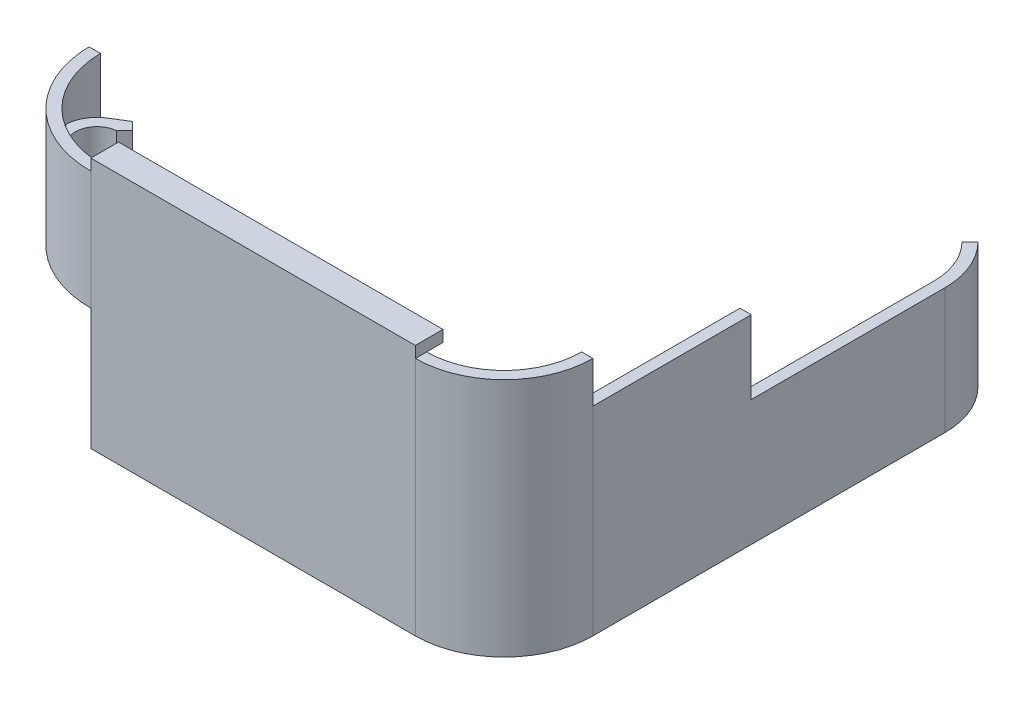
ISO-10303-21;
HEADER;
FILE_DESCRIPTION(('STEP AP214'),'2;1');
FILE_NAME('part.step','',(''),(''),'','','');
FILE_SCHEMA(('AUTOMOTIVE_DESIGN { 1 0 10303 214 1 1 1 1 }'));
ENDSEC;
DATA;
#1=APPLICATION_CONTEXT('core data for automotive mechanical design processes');
#2=APPLICATION_PROTOCOL_DEFINITION('international standard','automotive_design',2000,#1);
#3=PRODUCT_CONTEXT('',#1,'mechanical');
#4=PRODUCT('Part','Part','',(#3));
#5=PRODUCT_RELATED_PRODUCT_CATEGORY('part','',(#4));
#6=PRODUCT_DEFINITION_FORMATION('','',#4);
#7=PRODUCT_DEFINITION_CONTEXT('part definition',#1,'design');
#8=PRODUCT_DEFINITION('design','',#6,#7);
#9=PRODUCT_DEFINITION_SHAPE('','',#8);
#10=(LENGTH_UNIT() NAMED_UNIT(*) SI_UNIT(.MILLI.,.METRE.));
#11=(NAMED_UNIT(*) PLANE_ANGLE_UNIT() SI_UNIT($,.RADIAN.));
#12=(NAMED_UNIT(*) SI_UNIT($,.STERADIAN.) SOLID_ANGLE_UNIT());
#13=UNCERTAINTY_MEASURE_WITH_UNIT(LENGTH_MEASURE(1.E-05),#10,'distance_accuracy_value','');
#14=(GEOMETRIC_REPRESENTATION_CONTEXT(3) GLOBAL_UNCERTAINTY_ASSIGNED_CONTEXT((#13)) GLOBAL_UNIT_ASSIGNED_CONTEXT((#10,
#11,#12)) REPRESENTATION_CONTEXT('',''));
#15=CARTESIAN_POINT('',(0.,0.,0.));
#16=DIRECTION('',(0.,0.,1.));
#17=DIRECTION('',(1.,0.,0.));
#18=AXIS2_PLACEMENT_3D('',#15,#16,#17);
#19=CARTESIAN_POINT('',(72.898,53.975,4.4323));
#20=DIRECTION('',(0.,1.,0.));
#21=DIRECTION('',(1.,0.,0.));
#22=AXIS2_PLACEMENT_3D('',#19,#20,#21);
#23=PLANE('',#22);
#24=DIRECTION('',(0.,0.,1.));
#25=VECTOR('',#24,1.);
#26=CARTESIAN_POINT('',(0.,53.975,24.384));
#27=LINE('',#26,#25);
#28=CARTESIAN_POINT('',(0.,53.975,21.844));
#29=VERTEX_POINT('',#28);
#30=CARTESIAN_POINT('',(0.,53.975,24.384));
#31=VERTEX_POINT('',#30);
#32=EDGE_CURVE('E11',#29,#31,#27,.T.);
#33=ORIENTED_EDGE('',*,*,#32,.F.);
#34=CARTESIAN_POINT('',(0.,53.975,0.));
#35=DIRECTION('',(0.,1.,0.));
#36=DIRECTION('',(0.,0.,-1.));
#37=AXIS2_PLACEMENT_3D('',#34,#35,#36);
#38=CIRCLE('',#37,21.844);
#39=CARTESIAN_POINT('',(-21.8406730529962,53.975,0.381230366215963));
#40=VERTEX_POINT('',#39);
#41=EDGE_CURVE('E415',#40,#29,#38,.T.);
#42=ORIENTED_EDGE('',*,*,#41,.F.);
#43=DIRECTION('',(0.999847695156391,0.,-0.0174524064372779));
#44=VECTOR('',#43,1.);
#45=CARTESIAN_POINT('',(-24.3802861986934,53.975,0.425559478566648));
#46=LINE('',#45,#44);
#47=CARTESIAN_POINT('',(-24.3802861986934,53.975,0.425559478566648));
#48=VERTEX_POINT('',#47);
#49=EDGE_CURVE('E418',#48,#40,#46,.T.);
#50=ORIENTED_EDGE('',*,*,#49,.F.);
#51=CARTESIAN_POINT('',(0.,53.975,0.));
#52=DIRECTION('',(0.,1.,0.));
#53=DIRECTION('',(1.,0.,0.));
#54=AXIS2_PLACEMENT_3D('',#51,#52,#53);
#55=CIRCLE('',#54,24.384);
#56=EDGE_CURVE('E421',#48,#31,#55,.T.);
#57=ORIENTED_EDGE('',*,*,#56,.T.);
#58=EDGE_LOOP('',(#33,#42,#50,#57));
#59=FACE_BOUND('',#58,.T.);
#60=ADVANCED_FACE('F36',(#59),#23,.T.);
#61=CARTESIAN_POINT('',(90.3097,53.975,4.4323));
#62=DIRECTION('',(0.,0.,-1.));
#63=DIRECTION('',(-1.,0.,0.));
#64=AXIS2_PLACEMENT_3D('',#61,#62,#63);
#65=PLANE('',#64);
#66=DIRECTION('',(0.,-1.,0.));
#67=VECTOR('',#66,1.);
#68=CARTESIAN_POINT('',(92.8497,53.975,4.4323));
#69=LINE('',#68,#67);
#70=CARTESIAN_POINT('',(92.8497,53.975,4.4323));
#71=VERTEX_POINT('',#70);
#72=CARTESIAN_POINT('',(92.8497,44.704,4.4323));
#73=VERTEX_POINT('',#72);
#74=EDGE_CURVE('E451',#71,#73,#69,.T.);
#75=ORIENTED_EDGE('',*,*,#74,.T.);
#76=DIRECTION('',(1.,0.,0.));
#77=VECTOR('',#76,1.);
#78=CARTESIAN_POINT('',(90.3097,44.704,4.4323));
#79=LINE('',#78,#77);
#80=CARTESIAN_POINT('',(90.3097,44.704,4.4323));
#81=VERTEX_POINT('',#80);
#82=EDGE_CURVE('E269',#81,#73,#79,.T.);
#83=ORIENTED_EDGE('',*,*,#82,.F.);
#84=DIRECTION('',(0.,-1.,0.));
#85=VECTOR('',#84,1.);
#86=CARTESIAN_POINT('',(90.3097,53.975,4.4323));
#87=LINE('',#86,#85);
#88=CARTESIAN_POINT('',(90.3097,53.975,4.4323));
#89=VERTEX_POINT('',#88);
#90=EDGE_CURVE('E448',#89,#81,#87,.T.);
#91=ORIENTED_EDGE('',*,*,#90,.F.);
#92=DIRECTION('',(1.,0.,0.));
#93=VECTOR('',#92,1.);
#94=CARTESIAN_POINT('',(90.3097,53.975,4.4323));
#95=LINE('',#94,#93);
#96=EDGE_CURVE('E406',#89,#71,#95,.T.);
#97=ORIENTED_EDGE('',*,*,#96,.T.);
#98=EDGE_LOOP('',(#75,#83,#91,#97));
#99=FACE_BOUND('',#98,.T.);
#100=ADVANCED_FACE('F494',(#99),#65,.T.);
#101=CARTESIAN_POINT('',(75.00366,28.194,-74.676));
#102=DIRECTION('',(0.,1.,0.));
#103=DIRECTION('',(0.,0.,1.));
#104=AXIS2_PLACEMENT_3D('',#101,#102,#103);
#105=PLANE('',#104);
#106=DIRECTION('',(0.,0.,1.));
#107=VECTOR('',#106,1.);
#108=CARTESIAN_POINT('',(90.3097,28.194,4.4323));
#109=LINE('',#108,#107);
#110=CARTESIAN_POINT('',(90.3097,28.194,-74.676));
#111=VERTEX_POINT('',#110);
#112=CARTESIAN_POINT('',(90.3097,28.194,-31.1277));
#113=VERTEX_POINT('',#112);
#114=EDGE_CURVE('E296',#111,#113,#109,.T.);
#115=ORIENTED_EDGE('',*,*,#114,.T.);
#116=DIRECTION('',(-1.,0.,0.));
#117=VECTOR('',#116,1.);
#118=CARTESIAN_POINT('',(90.3097,28.194,-31.1277));
#119=LINE('',#118,#117);
#120=CARTESIAN_POINT('',(92.8497,28.194,-31.1277));
#121=VERTEX_POINT('',#120);
#122=EDGE_CURVE('E259',#121,#113,#119,.T.);
#123=ORIENTED_EDGE('',*,*,#122,.F.);
#124=DIRECTION('',(0.,0.,-1.));
#125=VECTOR('',#124,1.);
#126=CARTESIAN_POINT('',(92.8497,28.194,4.4323));
#127=LINE('',#126,#125);
#128=CARTESIAN_POINT('',(92.8497,28.194,-74.676));
#129=VERTEX_POINT('',#128);
#130=EDGE_CURVE('E299',#121,#129,#127,.T.);
#131=ORIENTED_EDGE('',*,*,#130,.T.);
#132=CARTESIAN_POINT('',(75.00366,28.194,-74.676));
#133=DIRECTION('',(0.,1.,0.));
#134=DIRECTION('',(0.,0.,1.));
#135=AXIS2_PLACEMENT_3D('',#132,#133,#134);
#136=CIRCLE('',#135,17.84604);
#137=CARTESIAN_POINT('',(87.6227159013265,28.194,-87.2950559013262));
#138=VERTEX_POINT('',#137);
#139=EDGE_CURVE('E302',#129,#138,#136,.T.);
#140=ORIENTED_EDGE('',*,*,#139,.T.);
#141=DIRECTION('',(-0.707106781186556,0.,0.707106781186539));
#142=VECTOR('',#141,1.);
#143=CARTESIAN_POINT('',(85.8266646771127,28.194,-85.4990046771124));
#144=LINE('',#143,#142);
#145=CARTESIAN_POINT('',(85.8266646771127,28.194,-85.4990046771124));
#146=VERTEX_POINT('',#145);
#147=EDGE_CURVE('E304',#138,#146,#144,.T.);
#148=ORIENTED_EDGE('',*,*,#147,.T.);
#149=CARTESIAN_POINT('',(75.00366,28.194,-74.676));
#150=DIRECTION('',(0.,-1.,0.));
#151=DIRECTION('',(0.,0.,1.));
#152=AXIS2_PLACEMENT_3D('',#149,#150,#151);
#153=CIRCLE('',#152,15.30604);
#154=EDGE_CURVE('E306',#146,#111,#153,.T.);
#155=ORIENTED_EDGE('',*,*,#154,.T.);
#156=EDGE_LOOP('',(#115,#123,#131,#140,#148,#155));
#157=FACE_BOUND('',#156,.T.);
#158=ADVANCED_FACE('F501',(#157),#105,.T.);
#159=CARTESIAN_POINT('',(0.,53.975,0.));
#160=DIRECTION('',(0.,-1.,0.));
#161=DIRECTION('',(0.,0.,-1.));
#162=AXIS2_PLACEMENT_3D('',#159,#160,#161);
#163=CYLINDRICAL_SURFACE('',#162,21.844);
#164=CARTESIAN_POINT('',(0.,27.305,0.));
#165=DIRECTION('',(0.,1.,0.));
#166=DIRECTION('',(0.,0.,1.));
#167=AXIS2_PLACEMENT_3D('',#164,#165,#166);
#168=CIRCLE('',#167,21.844);
#169=CARTESIAN_POINT('',(-21.8406730529962,27.305,0.381230366215898));
#170=VERTEX_POINT('',#169);
#171=CARTESIAN_POINT('',(0.,27.305,21.844));
#172=VERTEX_POINT('',#171);
#173=EDGE_CURVE('E293',#170,#172,#168,.T.);
#174=ORIENTED_EDGE('',*,*,#173,.F.);
#175=DIRECTION('',(0.,-1.,0.));
#176=VECTOR('',#175,1.);
#177=CARTESIAN_POINT('',(-21.8406730529962,53.975,0.381230366215963));
#178=LINE('',#177,#176);
#179=EDGE_CURVE('E440',#40,#170,#178,.T.);
#180=ORIENTED_EDGE('',*,*,#179,.F.);
#181=ORIENTED_EDGE('',*,*,#41,.T.);
#182=DIRECTION('',(0.,-1.,0.));
#183=VECTOR('',#182,1.);
#184=CARTESIAN_POINT('',(0.,53.975,21.844));
#185=LINE('',#184,#183);
#186=EDGE_CURVE('E443',#29,#172,#185,.T.);
#187=ORIENTED_EDGE('',*,*,#186,.T.);
#188=EDGE_LOOP('',(#174,#180,#181,#187));
#189=FACE_BOUND('',#188,.T.);
#190=DIRECTION('',(0.,-1.,0.));
#191=VECTOR('',#190,1.);
#192=CARTESIAN_POINT('',(-10.9598628470482,46.99,18.8955482157541));
#193=LINE('',#192,#191);
#194=CARTESIAN_POINT('',(-10.9598628470484,46.99,18.8955482157541));
#195=VERTEX_POINT('',#194);
#196=CARTESIAN_POINT('',(-10.9598628470484,27.94,18.8955482157541));
#197=VERTEX_POINT('',#196);
#198=EDGE_CURVE('E398',#195,#197,#193,.T.);
#199=ORIENTED_EDGE('',*,*,#198,.F.);
#200=CARTESIAN_POINT('',(0.,46.99,0.));
#201=DIRECTION('',(0.,1.,0.));
#202=DIRECTION('',(0.,0.,-1.));
#203=AXIS2_PLACEMENT_3D('',#200,#201,#202);
#204=CIRCLE('',#203,21.8439999999999);
#205=CARTESIAN_POINT('',(-18.8955482157542,46.99,10.9598628470482));
#206=VERTEX_POINT('',#205);
#207=EDGE_CURVE('E61',#206,#195,#204,.T.);
#208=ORIENTED_EDGE('',*,*,#207,.F.);
#209=DIRECTION('',(0.,-1.,0.));
#210=VECTOR('',#209,1.);
#211=CARTESIAN_POINT('',(-18.8955482157542,46.99,10.9598628470481));
#212=LINE('',#211,#210);
#213=CARTESIAN_POINT('',(-18.8955482157542,27.94,10.9598628470481));
#214=VERTEX_POINT('',#213);
#215=EDGE_CURVE('E401',#206,#214,#212,.T.);
#216=ORIENTED_EDGE('',*,*,#215,.T.);
#217=CARTESIAN_POINT('',(0.,27.94,0.));
#218=DIRECTION('',(0.,1.,0.));
#219=DIRECTION('',(0.,0.,-1.));
#220=AXIS2_PLACEMENT_3D('',#217,#218,#219);
#221=CIRCLE('',#220,21.8439999999999);
#222=EDGE_CURVE('E358',#214,#197,#221,.T.);
#223=ORIENTED_EDGE('',*,*,#222,.T.);
#224=EDGE_LOOP('',(#199,#208,#216,#223));
#225=FACE_BOUND('',#224,.T.);
#226=ADVANCED_FACE('F471',(#189,#225),#163,.F.);
#227=CARTESIAN_POINT('',(72.898,53.975,4.4323));
#228=DIRECTION('',(0.,-1.,0.));
#229=DIRECTION('',(0.,0.,-1.));
#230=AXIS2_PLACEMENT_3D('',#227,#228,#229);
#231=CYLINDRICAL_SURFACE('',#230,19.9517);
#232=CARTESIAN_POINT('',(72.898,0.,4.4323));
#233=DIRECTION('',(0.,1.,0.));
#234=DIRECTION('',(1.,0.,0.));
#235=AXIS2_PLACEMENT_3D('',#232,#233,#234);
#236=CIRCLE('',#235,19.9517);
#237=CARTESIAN_POINT('',(72.898,0.,24.384));
#238=VERTEX_POINT('',#237);
#239=CARTESIAN_POINT('',(92.8497,0.,4.4323));
#240=VERTEX_POINT('',#239);
#241=EDGE_CURVE('E403',#238,#240,#236,.T.);
#242=ORIENTED_EDGE('',*,*,#241,.T.);
#243=DIRECTION('',(0.,-1.,0.));
#244=VECTOR('',#243,1.);
#245=CARTESIAN_POINT('',(92.8497,28.194,4.4323));
#246=LINE('',#245,#244);
#247=EDGE_CURVE('E328',#73,#240,#246,.T.);
#248=ORIENTED_EDGE('',*,*,#247,.F.);
#249=ORIENTED_EDGE('',*,*,#74,.F.);
#250=CARTESIAN_POINT('',(72.898,53.975,4.4323));
#251=DIRECTION('',(0.,1.,0.));
#252=DIRECTION('',(1.,0.,0.));
#253=AXIS2_PLACEMENT_3D('',#250,#251,#252);
#254=CIRCLE('',#253,19.9517);
#255=CARTESIAN_POINT('',(72.898,53.975,24.384));
#256=VERTEX_POINT('',#255);
#257=EDGE_CURVE('E404',#256,#71,#254,.T.);
#258=ORIENTED_EDGE('',*,*,#257,.F.);
#259=DIRECTION('',(0.,-1.,0.));
#260=VECTOR('',#259,1.);
#261=CARTESIAN_POINT('',(72.898,53.975,24.384));
#262=LINE('',#261,#260);
#263=EDGE_CURVE('E423',#256,#238,#262,.T.);
#264=ORIENTED_EDGE('',*,*,#263,.T.);
#265=EDGE_LOOP('',(#242,#248,#249,#258,#264));
#266=FACE_BOUND('',#265,.T.);
#267=ADVANCED_FACE('F38',(#266),#231,.T.);
#268=CARTESIAN_POINT('',(72.898,53.975,4.4323));
#269=DIRECTION('',(0.,-1.,0.));
#270=DIRECTION('',(0.,0.,-1.));
#271=AXIS2_PLACEMENT_3D('',#268,#269,#270);
#272=CYLINDRICAL_SURFACE('',#271,17.4117);
#273=CARTESIAN_POINT('',(72.898,0.,4.4323));
#274=DIRECTION('',(0.,1.,0.));
#275=DIRECTION('',(0.,0.,1.));
#276=AXIS2_PLACEMENT_3D('',#273,#274,#275);
#277=CIRCLE('',#276,17.4117);
#278=CARTESIAN_POINT('',(72.898,0.,21.844));
#279=VERTEX_POINT('',#278);
#280=CARTESIAN_POINT('',(90.3097,0.,4.4323));
#281=VERTEX_POINT('',#280);
#282=EDGE_CURVE('E426',#279,#281,#277,.T.);
#283=ORIENTED_EDGE('',*,*,#282,.F.);
#284=DIRECTION('',(0.,-1.,0.));
#285=VECTOR('',#284,1.);
#286=CARTESIAN_POINT('',(72.898,53.975,21.844));
#287=LINE('',#286,#285);
#288=CARTESIAN_POINT('',(72.898,53.975,21.844));
#289=VERTEX_POINT('',#288);
#290=EDGE_CURVE('E446',#289,#279,#287,.T.);
#291=ORIENTED_EDGE('',*,*,#290,.F.);
#292=CARTESIAN_POINT('',(72.898,53.975,4.4323));
#293=DIRECTION('',(0.,1.,0.));
#294=DIRECTION('',(0.,0.,1.));
#295=AXIS2_PLACEMENT_3D('',#292,#293,#294);
#296=CIRCLE('',#295,17.4117);
#297=EDGE_CURVE('E410',#289,#89,#296,.T.);
#298=ORIENTED_EDGE('',*,*,#297,.T.);
#299=ORIENTED_EDGE('',*,*,#90,.T.);
#300=DIRECTION('',(0.,-1.,0.));
#301=VECTOR('',#300,1.);
#302=CARTESIAN_POINT('',(90.3097,28.194,4.4323));
#303=LINE('',#302,#301);
#304=EDGE_CURVE('E331',#81,#281,#303,.T.);
#305=ORIENTED_EDGE('',*,*,#304,.T.);
#306=EDGE_LOOP('',(#283,#291,#298,#299,#305));
#307=FACE_BOUND('',#306,.T.);
#308=ADVANCED_FACE('F820',(#307),#272,.F.);
#309=CARTESIAN_POINT('',(0.,53.975,21.844));
#310=DIRECTION('',(0.,0.,-1.));
#311=DIRECTION('',(-1.,0.,0.));
#312=AXIS2_PLACEMENT_3D('',#309,#310,#311);
#313=PLANE('',#312);
#314=DIRECTION('',(1.,0.,0.));
#315=VECTOR('',#314,1.);
#316=CARTESIAN_POINT('',(0.,0.,21.844));
#317=LINE('',#316,#315);
#318=CARTESIAN_POINT('',(0.,0.,21.844));
#319=VERTEX_POINT('',#318);
#320=EDGE_CURVE('E429',#319,#279,#317,.T.);
#321=ORIENTED_EDGE('',*,*,#320,.F.);
#322=DIRECTION('',(0.,-1.,0.));
#323=VECTOR('',#322,1.);
#324=CARTESIAN_POINT('',(0.,53.975,21.844));
#325=LINE('',#324,#323);
#326=EDGE_CURVE('E288',#172,#319,#325,.T.);
#327=ORIENTED_EDGE('',*,*,#326,.F.);
#328=ORIENTED_EDGE('',*,*,#186,.F.);
#329=DIRECTION('',(1.,0.,0.));
#330=VECTOR('',#329,1.);
#331=CARTESIAN_POINT('',(0.,53.975,21.844));
#332=LINE('',#331,#330);
#333=EDGE_CURVE('E413',#29,#289,#332,.T.);
#334=ORIENTED_EDGE('',*,*,#333,.T.);
#335=ORIENTED_EDGE('',*,*,#290,.T.);
#336=EDGE_LOOP('',(#321,#327,#328,#334,#335));
#337=FACE_BOUND('',#336,.T.);
#338=ADVANCED_FACE('F477',(#337),#313,.T.);
#339=CARTESIAN_POINT('',(-24.3802861986934,53.975,0.425559478566648));
#340=DIRECTION('',(-0.0174524064372779,0.,-0.999847695156391));
#341=DIRECTION('',(-0.999847695156391,0.,0.0174524064372779));
#342=AXIS2_PLACEMENT_3D('',#339,#340,#341);
#343=PLANE('',#342);
#344=DIRECTION('',(0.999847695156391,0.,-0.0174524064372779));
#345=VECTOR('',#344,1.);
#346=CARTESIAN_POINT('',(-0.381172302984591,27.305,0.00665338729743212));
#347=LINE('',#346,#345);
#348=CARTESIAN_POINT('',(-24.3802861986934,27.305,0.425559478566584));
#349=VERTEX_POINT('',#348);
#350=EDGE_CURVE('E280',#349,#170,#347,.T.);
#351=ORIENTED_EDGE('',*,*,#350,.F.);
#352=DIRECTION('',(0.,-1.,0.));
#353=VECTOR('',#352,1.);
#354=CARTESIAN_POINT('',(-24.3802861986934,53.975,0.425559478566648));
#355=LINE('',#354,#353);
#356=EDGE_CURVE('E437',#48,#349,#355,.T.);
#357=ORIENTED_EDGE('',*,*,#356,.F.);
#358=ORIENTED_EDGE('',*,*,#49,.T.);
#359=ORIENTED_EDGE('',*,*,#179,.T.);
#360=EDGE_LOOP('',(#351,#357,#358,#359));
#361=FACE_BOUND('',#360,.T.);
#362=ADVANCED_FACE('F468',(#361),#343,.T.);
#363=CARTESIAN_POINT('',(0.,53.975,0.));
#364=DIRECTION('',(0.,-1.,0.));
#365=DIRECTION('',(0.,0.,-1.));
#366=AXIS2_PLACEMENT_3D('',#363,#364,#365);
#367=CYLINDRICAL_SURFACE('',#366,24.384);
#368=ORIENTED_EDGE('',*,*,#356,.T.);
#369=CARTESIAN_POINT('',(0.,27.305,0.));
#370=DIRECTION('',(0.,1.,0.));
#371=DIRECTION('',(0.,0.,1.));
#372=AXIS2_PLACEMENT_3D('',#369,#370,#371);
#373=CIRCLE('',#372,24.384);
#374=CARTESIAN_POINT('',(0.,27.305,24.384));
#375=VERTEX_POINT('',#374);
#376=EDGE_CURVE('E290',#349,#375,#373,.T.);
#377=ORIENTED_EDGE('',*,*,#376,.T.);
#378=DIRECTION('',(0.,-1.,0.));
#379=VECTOR('',#378,1.);
#380=CARTESIAN_POINT('',(0.,53.975,24.384));
#381=LINE('',#380,#379);
#382=EDGE_CURVE('E435',#31,#375,#381,.T.);
#383=ORIENTED_EDGE('',*,*,#382,.F.);
#384=ORIENTED_EDGE('',*,*,#56,.F.);
#385=EDGE_LOOP('',(#368,#377,#383,#384));
#386=FACE_BOUND('',#385,.T.);
#387=ADVANCED_FACE('F464',(#386),#367,.T.);
#388=CARTESIAN_POINT('',(0.,53.975,24.384));
#389=DIRECTION('',(0.,0.,-1.));
#390=DIRECTION('',(-1.,0.,0.));
#391=AXIS2_PLACEMENT_3D('',#388,#389,#390);
#392=PLANE('',#391);
#393=DIRECTION('',(1.,0.,0.));
#394=VECTOR('',#393,1.);
#395=CARTESIAN_POINT('',(0.,27.305,24.384));
#396=LINE('',#395,#394);
#397=CARTESIAN_POINT('',(0.0443358649176609,27.305,24.384));
#398=VERTEX_POINT('',#397);
#399=EDGE_CURVE('E40',#375,#398,#396,.T.);
#400=ORIENTED_EDGE('',*,*,#399,.T.);
#401=DIRECTION('',(0.,-1.,0.));
#402=VECTOR('',#401,1.);
#403=CARTESIAN_POINT('',(0.0443358649176641,53.975,24.384));
#404=LINE('',#403,#402);
#405=CARTESIAN_POINT('',(0.0443358649176569,0.,24.384));
#406=VERTEX_POINT('',#405);
#407=EDGE_CURVE('E285',#398,#406,#404,.T.);
#408=ORIENTED_EDGE('',*,*,#407,.T.);
#409=DIRECTION('',(1.,0.,0.));
#410=VECTOR('',#409,1.);
#411=CARTESIAN_POINT('',(0.,0.,24.384));
#412=LINE('',#411,#410);
#413=EDGE_CURVE('E407',#406,#238,#412,.T.);
#414=ORIENTED_EDGE('',*,*,#413,.T.);
#415=ORIENTED_EDGE('',*,*,#263,.F.);
#416=DIRECTION('',(0.,-1.,0.));
#417=VECTOR('',#416,1.);
#418=CARTESIAN_POINT('',(72.898,56.515,24.384));
#419=LINE('',#418,#417);
#420=CARTESIAN_POINT('',(72.898,56.515,24.384));
#421=VERTEX_POINT('',#420);
#422=EDGE_CURVE('E242',#421,#256,#419,.T.);
#423=ORIENTED_EDGE('',*,*,#422,.F.);
#424=DIRECTION('',(1.,0.,0.));
#425=VECTOR('',#424,1.);
#426=CARTESIAN_POINT('',(0.,56.515,24.384));
#427=LINE('',#426,#425);
#428=CARTESIAN_POINT('',(0.,56.515,24.384));
#429=VERTEX_POINT('',#428);
#430=EDGE_CURVE('E233',#429,#421,#427,.T.);
#431=ORIENTED_EDGE('',*,*,#430,.F.);
#432=DIRECTION('',(0.,-1.,0.));
#433=VECTOR('',#432,1.);
#434=CARTESIAN_POINT('',(0.,56.515,24.384));
#435=LINE('',#434,#433);
#436=EDGE_CURVE('E239',#429,#31,#435,.T.);
#437=ORIENTED_EDGE('',*,*,#436,.T.);
#438=ORIENTED_EDGE('',*,*,#382,.T.);
#439=EDGE_LOOP('',(#400,#408,#414,#415,#423,#431,#437,#438));
#440=FACE_BOUND('',#439,.T.);
#441=ADVANCED_FACE('F236',(#440),#392,.F.);
#442=DIRECTION('',(0.,0.,-1.));
#443=VECTOR('',#442,1.);
#444=CARTESIAN_POINT('',(72.898,53.975,24.384));
#445=LINE('',#444,#443);
#446=EDGE_CURVE('E515',#256,#289,#445,.T.);
#447=ORIENTED_EDGE('',*,*,#446,.F.);
#448=ORIENTED_EDGE('',*,*,#257,.T.);
#449=ORIENTED_EDGE('',*,*,#96,.F.);
#450=ORIENTED_EDGE('',*,*,#297,.F.);
#451=EDGE_LOOP('',(#447,#448,#449,#450));
#452=FACE_BOUND('',#451,.T.);
#453=ADVANCED_FACE('F497',(#452),#23,.T.);
#454=CARTESIAN_POINT('',(72.898,0.,4.4323));
#455=DIRECTION('',(0.,1.,0.));
#456=DIRECTION('',(1.,0.,0.));
#457=AXIS2_PLACEMENT_3D('',#454,#455,#456);
#458=PLANE('',#457);
#459=ORIENTED_EDGE('',*,*,#413,.F.);
#460=DIRECTION('',(-0.0174524064372779,0.,-0.999847695156391));
#461=VECTOR('',#460,1.);
#462=CARTESIAN_POINT('',(-0.281626037386407,0.,5.70965512390485));
#463=LINE('',#462,#461);
#464=EDGE_CURVE('E453',#406,#319,#463,.T.);
#465=ORIENTED_EDGE('',*,*,#464,.T.);
#466=ORIENTED_EDGE('',*,*,#320,.T.);
#467=ORIENTED_EDGE('',*,*,#282,.T.);
#468=DIRECTION('',(0.,0.,1.));
#469=VECTOR('',#468,1.);
#470=CARTESIAN_POINT('',(90.3097,0.,4.4323));
#471=LINE('',#470,#469);
#472=CARTESIAN_POINT('',(90.3097,0.,-74.676));
#473=VERTEX_POINT('',#472);
#474=EDGE_CURVE('E295',#473,#281,#471,.T.);
#475=ORIENTED_EDGE('',*,*,#474,.F.);
#476=CARTESIAN_POINT('',(75.00366,0.,-74.676));
#477=DIRECTION('',(0.,-1.,0.));
#478=DIRECTION('',(0.,0.,1.));
#479=AXIS2_PLACEMENT_3D('',#476,#477,#478);
#480=CIRCLE('',#479,15.30604);
#481=CARTESIAN_POINT('',(85.8266646771127,0.,-85.4990046771124));
#482=VERTEX_POINT('',#481);
#483=EDGE_CURVE('E300',#482,#473,#480,.T.);
#484=ORIENTED_EDGE('',*,*,#483,.F.);
#485=DIRECTION('',(-0.707106781186556,0.,0.707106781186539));
#486=VECTOR('',#485,1.);
#487=CARTESIAN_POINT('',(85.8266646771127,0.,-85.4990046771124));
#488=LINE('',#487,#486);
#489=CARTESIAN_POINT('',(87.6227159013265,0.,-87.2950559013262));
#490=VERTEX_POINT('',#489);
#491=EDGE_CURVE('E314',#490,#482,#488,.T.);
#492=ORIENTED_EDGE('',*,*,#491,.F.);
#493=CARTESIAN_POINT('',(75.00366,0.,-74.676));
#494=DIRECTION('',(0.,1.,0.));
#495=DIRECTION('',(0.,0.,1.));
#496=AXIS2_PLACEMENT_3D('',#493,#494,#495);
#497=CIRCLE('',#496,17.84604);
#498=CARTESIAN_POINT('',(92.8497,0.,-74.676));
#499=VERTEX_POINT('',#498);
#500=EDGE_CURVE('E312',#499,#490,#497,.T.);
#501=ORIENTED_EDGE('',*,*,#500,.F.);
#502=DIRECTION('',(0.,0.,-1.));
#503=VECTOR('',#502,1.);
#504=CARTESIAN_POINT('',(92.8497,0.,4.4323));
#505=LINE('',#504,#503);
#506=EDGE_CURVE('E310',#240,#499,#505,.T.);
#507=ORIENTED_EDGE('',*,*,#506,.F.);
#508=ORIENTED_EDGE('',*,*,#241,.F.);
#509=EDGE_LOOP('',(#459,#465,#466,#467,#475,#484,#492,#501,#507,#508));
#510=FACE_BOUND('',#509,.T.);
#511=ADVANCED_FACE('F506',(#510),#458,.F.);
#512=CARTESIAN_POINT('',(-11.498319937417,46.99,11.4983199374169));
#513=DIRECTION('',(0.,-1.,0.));
#514=DIRECTION('',(0.,0.,-1.));
#515=AXIS2_PLACEMENT_3D('',#512,#513,#514);
#516=CYLINDRICAL_SURFACE('',#515,7.4168);
#517=CARTESIAN_POINT('',(-11.498319937417,27.94,11.4983199374169));
#518=DIRECTION('',(0.,1.,0.));
#519=DIRECTION('',(0.,0.,-1.));
#520=AXIS2_PLACEMENT_3D('',#517,#518,#519);
#521=CIRCLE('',#520,7.4168);
#522=CARTESIAN_POINT('',(-15.6962117445499,27.94,5.38385948570027));
#523=VERTEX_POINT('',#522);
#524=EDGE_CURVE('E334',#523,#214,#521,.T.);
#525=ORIENTED_EDGE('',*,*,#524,.T.);
#526=ORIENTED_EDGE('',*,*,#215,.F.);
#527=CARTESIAN_POINT('',(-11.498319937417,46.99,11.4983199374169));
#528=DIRECTION('',(0.,1.,0.));
#529=DIRECTION('',(0.,0.,-1.));
#530=AXIS2_PLACEMENT_3D('',#527,#528,#529);
#531=CIRCLE('',#530,7.4168);
#532=CARTESIAN_POINT('',(-15.6962117445499,46.99,5.38385948570027));
#533=VERTEX_POINT('',#532);
#534=EDGE_CURVE('E335',#533,#206,#531,.T.);
#535=ORIENTED_EDGE('',*,*,#534,.F.);
#536=DIRECTION('',(0.,-1.,0.));
#537=VECTOR('',#536,1.);
#538=CARTESIAN_POINT('',(-15.6962117445499,46.99,5.38385948570027));
#539=LINE('',#538,#537);
#540=EDGE_CURVE('E355',#533,#523,#539,.T.);
#541=ORIENTED_EDGE('',*,*,#540,.T.);
#542=EDGE_LOOP('',(#525,#526,#535,#541));
#543=FACE_BOUND('',#542,.T.);
#544=ADVANCED_FACE('F512',(#543),#516,.T.);
#545=CARTESIAN_POINT('',(-11.498319937417,46.99,11.4983199374169));
#546=DIRECTION('',(0.,-1.,0.));
#547=DIRECTION('',(0.,0.,-1.));
#548=AXIS2_PLACEMENT_3D('',#545,#546,#547);
#549=CYLINDRICAL_SURFACE('',#548,7.4168);
#550=CARTESIAN_POINT('',(-11.498319937417,27.94,11.4983199374169));
#551=DIRECTION('',(0.,1.,0.));
#552=DIRECTION('',(0.,0.,1.));
#553=AXIS2_PLACEMENT_3D('',#550,#551,#552);
#554=CIRCLE('',#553,7.4168);
#555=CARTESIAN_POINT('',(-5.3838594857004,27.94,15.6962117445498));
#556=VERTEX_POINT('',#555);
#557=EDGE_CURVE('E360',#197,#556,#554,.T.);
#558=ORIENTED_EDGE('',*,*,#557,.T.);
#559=DIRECTION('',(0.,-1.,0.));
#560=VECTOR('',#559,1.);
#561=CARTESIAN_POINT('',(-5.3838594857004,46.99,15.6962117445498));
#562=LINE('',#561,#560);
#563=CARTESIAN_POINT('',(-5.3838594857004,46.99,15.6962117445498));
#564=VERTEX_POINT('',#563);
#565=EDGE_CURVE('E395',#564,#556,#562,.T.);
#566=ORIENTED_EDGE('',*,*,#565,.F.);
#567=CARTESIAN_POINT('',(-11.498319937417,46.99,11.4983199374169));
#568=DIRECTION('',(0.,1.,0.));
#569=DIRECTION('',(0.,0.,1.));
#570=AXIS2_PLACEMENT_3D('',#567,#568,#569);
#571=CIRCLE('',#570,7.4168);
#572=EDGE_CURVE('E339',#195,#564,#571,.T.);
#573=ORIENTED_EDGE('',*,*,#572,.F.);
#574=ORIENTED_EDGE('',*,*,#198,.T.);
#575=EDGE_LOOP('',(#558,#566,#573,#574));
#576=FACE_BOUND('',#575,.T.);
#577=ADVANCED_FACE('F771',(#576),#549,.T.);
#578=CARTESIAN_POINT('',(-3.0458511648099,46.99,11.9363529340721));
#579=DIRECTION('',(-0.849204423107518,0.,-0.52806424587793));
#580=DIRECTION('',(-0.52806424587793,0.,0.849204423107518));
#581=AXIS2_PLACEMENT_3D('',#578,#579,#580);
#582=PLANE('',#581);
#583=DIRECTION('',(0.52806424587793,0.,-0.849204423107518));
#584=VECTOR('',#583,1.);
#585=CARTESIAN_POINT('',(-3.0458511648099,27.94,11.9363529340721));
#586=LINE('',#585,#584);
#587=CARTESIAN_POINT('',(-3.0458511648099,27.94,11.9363529340721));
#588=VERTEX_POINT('',#587);
#589=EDGE_CURVE('E362',#556,#588,#586,.T.);
#590=ORIENTED_EDGE('',*,*,#589,.T.);
#591=DIRECTION('',(0.,-1.,0.));
#592=VECTOR('',#591,1.);
#593=CARTESIAN_POINT('',(-3.0458511648099,46.99,11.9363529340721));
#594=LINE('',#593,#592);
#595=CARTESIAN_POINT('',(-3.0458511648099,46.99,11.9363529340721));
#596=VERTEX_POINT('',#595);
#597=EDGE_CURVE('E392',#596,#588,#594,.T.);
#598=ORIENTED_EDGE('',*,*,#597,.F.);
#599=DIRECTION('',(0.52806424587793,0.,-0.849204423107518));
#600=VECTOR('',#599,1.);
#601=CARTESIAN_POINT('',(-3.0458511648099,46.99,11.9363529340721));
#602=LINE('',#601,#600);
#603=EDGE_CURVE('E341',#564,#596,#602,.T.);
#604=ORIENTED_EDGE('',*,*,#603,.F.);
#605=ORIENTED_EDGE('',*,*,#565,.T.);
#606=EDGE_LOOP('',(#590,#598,#604,#605));
#607=FACE_BOUND('',#606,.T.);
#608=ADVANCED_FACE('F761',(#607),#582,.F.);
#609=CARTESIAN_POINT('',(-4.8435414742103,46.99,10.1386626246722));
#610=DIRECTION('',(-0.707106781186456,0.,0.707106781186639));
#611=DIRECTION('',(0.707106781186639,0.,0.707106781186456));
#612=AXIS2_PLACEMENT_3D('',#609,#610,#611);
#613=PLANE('',#612);
#614=DIRECTION('',(-0.707106781186639,0.,-0.707106781186456));
#615=VECTOR('',#614,1.);
#616=CARTESIAN_POINT('',(-4.8435414742103,27.94,10.1386626246722));
#617=LINE('',#616,#615);
#618=CARTESIAN_POINT('',(-4.8435414742103,27.94,10.1386626246722));
#619=VERTEX_POINT('',#618);
#620=EDGE_CURVE('E364',#588,#619,#617,.T.);
#621=ORIENTED_EDGE('',*,*,#620,.T.);
#622=DIRECTION('',(0.,-1.,0.));
#623=VECTOR('',#622,1.);
#624=CARTESIAN_POINT('',(-4.8435414742103,46.99,10.1386626246722));
#625=LINE('',#624,#623);
#626=CARTESIAN_POINT('',(-4.8435414742103,46.99,10.1386626246722));
#627=VERTEX_POINT('',#626);
#628=EDGE_CURVE('E389',#627,#619,#625,.T.);
#629=ORIENTED_EDGE('',*,*,#628,.F.);
#630=DIRECTION('',(-0.707106781186639,0.,-0.707106781186456));
#631=VECTOR('',#630,1.);
#632=CARTESIAN_POINT('',(-4.8435414742103,46.99,10.1386626246722));
#633=LINE('',#632,#631);
#634=EDGE_CURVE('E343',#596,#627,#633,.T.);
#635=ORIENTED_EDGE('',*,*,#634,.F.);
#636=ORIENTED_EDGE('',*,*,#597,.T.);
#637=EDGE_LOOP('',(#621,#629,#635,#636));
#638=FACE_BOUND('',#637,.T.);
#639=ADVANCED_FACE('F751',(#638),#613,.F.);
#640=CARTESIAN_POINT('',(-6.64123178361119,46.99,11.9363529340727));
#641=DIRECTION('',(0.707106781186469,0.,0.707106781186627));
#642=DIRECTION('',(0.707106781186627,0.,-0.707106781186469));
#643=AXIS2_PLACEMENT_3D('',#640,#641,#642);
#644=PLANE('',#643);
#645=DIRECTION('',(-0.707106781186627,0.,0.707106781186469));
#646=VECTOR('',#645,1.);
#647=CARTESIAN_POINT('',(-6.64123178361119,27.94,11.9363529340727));
#648=LINE('',#647,#646);
#649=CARTESIAN_POINT('',(-6.64123178361119,27.94,11.9363529340727));
#650=VERTEX_POINT('',#649);
#651=EDGE_CURVE('E366',#619,#650,#648,.T.);
#652=ORIENTED_EDGE('',*,*,#651,.T.);
#653=DIRECTION('',(0.,-1.,0.));
#654=VECTOR('',#653,1.);
#655=CARTESIAN_POINT('',(-6.64123178361119,46.99,11.9363529340727));
#656=LINE('',#655,#654);
#657=CARTESIAN_POINT('',(-6.64123178361119,46.99,11.9363529340727));
#658=VERTEX_POINT('',#657);
#659=EDGE_CURVE('E386',#658,#650,#656,.T.);
#660=ORIENTED_EDGE('',*,*,#659,.F.);
#661=DIRECTION('',(-0.707106781186627,0.,0.707106781186469));
#662=VECTOR('',#661,1.);
#663=CARTESIAN_POINT('',(-6.64123178361119,46.99,11.9363529340727));
#664=LINE('',#663,#662);
#665=EDGE_CURVE('E345',#627,#658,#664,.T.);
#666=ORIENTED_EDGE('',*,*,#665,.F.);
#667=ORIENTED_EDGE('',*,*,#628,.T.);
#668=EDGE_LOOP('',(#652,#660,#666,#667));
#669=FACE_BOUND('',#668,.T.);
#670=ADVANCED_FACE('F741',(#669),#644,.F.);
#671=CARTESIAN_POINT('',(-11.498319937417,46.99,11.4983199374169));
#672=DIRECTION('',(0.,-1.,0.));
#673=DIRECTION('',(0.,0.,-1.));
#674=AXIS2_PLACEMENT_3D('',#671,#672,#673);
#675=CYLINDRICAL_SURFACE('',#674,4.8768);
#676=CARTESIAN_POINT('',(-11.498319937417,27.94,11.4983199374169));
#677=DIRECTION('',(0.,-1.,0.));
#678=DIRECTION('',(0.,0.,1.));
#679=AXIS2_PLACEMENT_3D('',#676,#677,#678);
#680=CIRCLE('',#679,4.8768);
#681=CARTESIAN_POINT('',(-11.9363529340728,27.94,6.64123178361107));
#682=VERTEX_POINT('',#681);
#683=EDGE_CURVE('E368',#650,#682,#680,.T.);
#684=ORIENTED_EDGE('',*,*,#683,.T.);
#685=DIRECTION('',(0.,-1.,0.));
#686=VECTOR('',#685,1.);
#687=CARTESIAN_POINT('',(-11.9363529340728,46.99,6.64123178361107));
#688=LINE('',#687,#686);
#689=CARTESIAN_POINT('',(-11.9363529340728,46.99,6.64123178361107));
#690=VERTEX_POINT('',#689);
#691=EDGE_CURVE('E383',#690,#682,#688,.T.);
#692=ORIENTED_EDGE('',*,*,#691,.F.);
#693=CARTESIAN_POINT('',(-11.498319937417,46.99,11.4983199374169));
#694=DIRECTION('',(0.,-1.,0.));
#695=DIRECTION('',(0.,0.,1.));
#696=AXIS2_PLACEMENT_3D('',#693,#694,#695);
#697=CIRCLE('',#696,4.8768);
#698=EDGE_CURVE('E347',#658,#690,#697,.T.);
#699=ORIENTED_EDGE('',*,*,#698,.F.);
#700=ORIENTED_EDGE('',*,*,#659,.T.);
#701=EDGE_LOOP('',(#684,#692,#699,#700));
#702=FACE_BOUND('',#701,.T.);
#703=ADVANCED_FACE('F731',(#702),#675,.F.);
#704=CARTESIAN_POINT('',(-11.9363529340728,46.99,6.64123178361107));
#705=DIRECTION('',(-0.707106781186523,0.,-0.707106781186572));
#706=DIRECTION('',(-0.707106781186572,0.,0.707106781186523));
#707=AXIS2_PLACEMENT_3D('',#704,#705,#706);
#708=PLANE('',#707);
#709=DIRECTION('',(0.707106781186572,0.,-0.707106781186523));
#710=VECTOR('',#709,1.);
#711=CARTESIAN_POINT('',(-11.9363529340728,27.94,6.64123178361107));
#712=LINE('',#711,#710);
#713=CARTESIAN_POINT('',(-10.1386626246719,27.94,4.84354147421027));
#714=VERTEX_POINT('',#713);
#715=EDGE_CURVE('E370',#682,#714,#712,.T.);
#716=ORIENTED_EDGE('',*,*,#715,.T.);
#717=DIRECTION('',(0.,-1.,0.));
#718=VECTOR('',#717,1.);
#719=CARTESIAN_POINT('',(-10.1386626246719,46.99,4.84354147421027));
#720=LINE('',#719,#718);
#721=CARTESIAN_POINT('',(-10.1386626246719,46.99,4.84354147421027));
#722=VERTEX_POINT('',#721);
#723=EDGE_CURVE('E380',#722,#714,#720,.T.);
#724=ORIENTED_EDGE('',*,*,#723,.F.);
#725=DIRECTION('',(0.707106781186572,0.,-0.707106781186523));
#726=VECTOR('',#725,1.);
#727=CARTESIAN_POINT('',(-11.9363529340728,46.99,6.64123178361107));
#728=LINE('',#727,#726);
#729=EDGE_CURVE('E349',#690,#722,#728,.T.);
#730=ORIENTED_EDGE('',*,*,#729,.F.);
#731=ORIENTED_EDGE('',*,*,#691,.T.);
#732=EDGE_LOOP('',(#716,#724,#730,#731));
#733=FACE_BOUND('',#732,.T.);
#734=ADVANCED_FACE('F721',(#733),#708,.F.);
#735=CARTESIAN_POINT('',(-10.1386626246719,46.99,4.84354147421027));
#736=DIRECTION('',(-0.707106781186571,0.,0.707106781186524));
#737=DIRECTION('',(0.707106781186524,0.,0.707106781186571));
#738=AXIS2_PLACEMENT_3D('',#735,#736,#737);
#739=PLANE('',#738);
#740=DIRECTION('',(-0.707106781186524,0.,-0.707106781186571));
#741=VECTOR('',#740,1.);
#742=CARTESIAN_POINT('',(-10.1386626246719,27.94,4.84354147421027));
#743=LINE('',#742,#741);
#744=CARTESIAN_POINT('',(-11.9363529340722,27.94,3.04585116480978));
#745=VERTEX_POINT('',#744);
#746=EDGE_CURVE('E372',#714,#745,#743,.T.);
#747=ORIENTED_EDGE('',*,*,#746,.T.);
#748=DIRECTION('',(0.,-1.,0.));
#749=VECTOR('',#748,1.);
#750=CARTESIAN_POINT('',(-11.9363529340722,46.99,3.04585116480978));
#751=LINE('',#750,#749);
#752=CARTESIAN_POINT('',(-11.9363529340722,46.99,3.04585116480978));
#753=VERTEX_POINT('',#752);
#754=EDGE_CURVE('E377',#753,#745,#751,.T.);
#755=ORIENTED_EDGE('',*,*,#754,.F.);
#756=DIRECTION('',(-0.707106781186524,0.,-0.707106781186571));
#757=VECTOR('',#756,1.);
#758=CARTESIAN_POINT('',(-10.1386626246719,46.99,4.84354147421027));
#759=LINE('',#758,#757);
#760=EDGE_CURVE('E351',#722,#753,#759,.T.);
#761=ORIENTED_EDGE('',*,*,#760,.F.);
#762=ORIENTED_EDGE('',*,*,#723,.T.);
#763=EDGE_LOOP('',(#747,#755,#761,#762));
#764=FACE_BOUND('',#763,.T.);
#765=ADVANCED_FACE('F711',(#764),#739,.F.);
#766=CARTESIAN_POINT('',(-11.9363529340722,46.99,3.04585116480978));
#767=DIRECTION('',(0.528064245877929,0.,0.849204423107519));
#768=DIRECTION('',(0.849204423107519,0.,-0.528064245877929));
#769=AXIS2_PLACEMENT_3D('',#766,#767,#768);
#770=PLANE('',#769);
#771=DIRECTION('',(-0.849204423107519,0.,0.528064245877929));
#772=VECTOR('',#771,1.);
#773=CARTESIAN_POINT('',(-11.9363529340722,27.94,3.04585116480978));
#774=LINE('',#773,#772);
#775=EDGE_CURVE('E337',#745,#523,#774,.T.);
#776=ORIENTED_EDGE('',*,*,#775,.T.);
#777=ORIENTED_EDGE('',*,*,#540,.F.);
#778=DIRECTION('',(-0.849204423107519,0.,0.528064245877929));
#779=VECTOR('',#778,1.);
#780=CARTESIAN_POINT('',(-11.9363529340722,46.99,3.04585116480978));
#781=LINE('',#780,#779);
#782=EDGE_CURVE('E353',#753,#533,#781,.T.);
#783=ORIENTED_EDGE('',*,*,#782,.F.);
#784=ORIENTED_EDGE('',*,*,#754,.T.);
#785=EDGE_LOOP('',(#776,#777,#783,#784));
#786=FACE_BOUND('',#785,.T.);
#787=ADVANCED_FACE('F701',(#786),#770,.F.);
#788=CARTESIAN_POINT('',(-11.498319937417,46.99,11.4983199374169));
#789=DIRECTION('',(0.,-1.,0.));
#790=DIRECTION('',(0.,0.,-1.));
#791=AXIS2_PLACEMENT_3D('',#788,#789,#790);
#792=PLANE('',#791);
#793=ORIENTED_EDGE('',*,*,#534,.T.);
#794=ORIENTED_EDGE('',*,*,#207,.T.);
#795=ORIENTED_EDGE('',*,*,#572,.T.);
#796=ORIENTED_EDGE('',*,*,#603,.T.);
#797=ORIENTED_EDGE('',*,*,#634,.T.);
#798=ORIENTED_EDGE('',*,*,#665,.T.);
#799=ORIENTED_EDGE('',*,*,#698,.T.);
#800=ORIENTED_EDGE('',*,*,#729,.T.);
#801=ORIENTED_EDGE('',*,*,#760,.T.);
#802=ORIENTED_EDGE('',*,*,#782,.T.);
#803=EDGE_LOOP('',(#793,#794,#795,#796,#797,#798,#799,#800,#801,#802));
#804=FACE_BOUND('',#803,.T.);
#805=ADVANCED_FACE('F691',(#804),#792,.F.);
#806=CARTESIAN_POINT('',(-11.498319937417,27.94,11.4983199374169));
#807=DIRECTION('',(0.,-1.,0.));
#808=DIRECTION('',(0.,0.,-1.));
#809=AXIS2_PLACEMENT_3D('',#806,#807,#808);
#810=PLANE('',#809);
#811=ORIENTED_EDGE('',*,*,#524,.F.);
#812=ORIENTED_EDGE('',*,*,#775,.F.);
#813=ORIENTED_EDGE('',*,*,#746,.F.);
#814=ORIENTED_EDGE('',*,*,#715,.F.);
#815=ORIENTED_EDGE('',*,*,#683,.F.);
#816=ORIENTED_EDGE('',*,*,#651,.F.);
#817=ORIENTED_EDGE('',*,*,#620,.F.);
#818=ORIENTED_EDGE('',*,*,#589,.F.);
#819=ORIENTED_EDGE('',*,*,#557,.F.);
#820=ORIENTED_EDGE('',*,*,#222,.F.);
#821=EDGE_LOOP('',(#811,#812,#813,#814,#815,#816,#817,#818,#819,#820));
#822=FACE_BOUND('',#821,.T.);
#823=ADVANCED_FACE('F631',(#822),#810,.T.);
#824=CARTESIAN_POINT('',(90.3097,28.194,4.4323));
#825=DIRECTION('',(1.,0.,0.));
#826=DIRECTION('',(0.,0.,-1.));
#827=AXIS2_PLACEMENT_3D('',#824,#825,#826);
#828=PLANE('',#827);
#829=ORIENTED_EDGE('',*,*,#474,.T.);
#830=ORIENTED_EDGE('',*,*,#304,.F.);
#831=DIRECTION('',(0.,0.,1.));
#832=VECTOR('',#831,1.);
#833=CARTESIAN_POINT('',(90.3097,44.704,4.4323));
#834=LINE('',#833,#832);
#835=CARTESIAN_POINT('',(90.3097,44.704,-31.1277));
#836=VERTEX_POINT('',#835);
#837=EDGE_CURVE('E261',#836,#81,#834,.T.);
#838=ORIENTED_EDGE('',*,*,#837,.F.);
#839=DIRECTION('',(0.,-1.,0.));
#840=VECTOR('',#839,1.);
#841=CARTESIAN_POINT('',(90.3097,44.704,-31.1277));
#842=LINE('',#841,#840);
#843=EDGE_CURVE('E275',#836,#113,#842,.T.);
#844=ORIENTED_EDGE('',*,*,#843,.T.);
#845=ORIENTED_EDGE('',*,*,#114,.F.);
#846=DIRECTION('',(0.,-1.,0.));
#847=VECTOR('',#846,1.);
#848=CARTESIAN_POINT('',(90.3097,28.194,-74.676));
#849=LINE('',#848,#847);
#850=EDGE_CURVE('E308',#111,#473,#849,.T.);
#851=ORIENTED_EDGE('',*,*,#850,.T.);
#852=EDGE_LOOP('',(#829,#830,#838,#844,#845,#851));
#853=FACE_BOUND('',#852,.T.);
#854=ADVANCED_FACE('F618',(#853),#828,.F.);
#855=CARTESIAN_POINT('',(92.8497,28.194,4.4323));
#856=DIRECTION('',(-1.,0.,0.));
#857=DIRECTION('',(0.,0.,1.));
#858=AXIS2_PLACEMENT_3D('',#855,#856,#857);
#859=PLANE('',#858);
#860=ORIENTED_EDGE('',*,*,#506,.T.);
#861=DIRECTION('',(0.,-1.,0.));
#862=VECTOR('',#861,1.);
#863=CARTESIAN_POINT('',(92.8497,28.194,-74.676));
#864=LINE('',#863,#862);
#865=EDGE_CURVE('E325',#129,#499,#864,.T.);
#866=ORIENTED_EDGE('',*,*,#865,.F.);
#867=ORIENTED_EDGE('',*,*,#130,.F.);
#868=DIRECTION('',(0.,-1.,0.));
#869=VECTOR('',#868,1.);
#870=CARTESIAN_POINT('',(92.8497,44.704,-31.1277));
#871=LINE('',#870,#869);
#872=CARTESIAN_POINT('',(92.8497,44.704,-31.1277));
#873=VERTEX_POINT('',#872);
#874=EDGE_CURVE('E53',#873,#121,#871,.T.);
#875=ORIENTED_EDGE('',*,*,#874,.F.);
#876=DIRECTION('',(0.,0.,-1.));
#877=VECTOR('',#876,1.);
#878=CARTESIAN_POINT('',(92.8497,44.704,4.4323));
#879=LINE('',#878,#877);
#880=EDGE_CURVE('E272',#73,#873,#879,.T.);
#881=ORIENTED_EDGE('',*,*,#880,.F.);
#882=ORIENTED_EDGE('',*,*,#247,.T.);
#883=EDGE_LOOP('',(#860,#866,#867,#875,#881,#882));
#884=FACE_BOUND('',#883,.T.);
#885=ADVANCED_FACE('F611',(#884),#859,.F.);
#886=CARTESIAN_POINT('',(75.00366,28.194,-74.676));
#887=DIRECTION('',(0.,-1.,0.));
#888=DIRECTION('',(0.,0.,-1.));
#889=AXIS2_PLACEMENT_3D('',#886,#887,#888);
#890=CYLINDRICAL_SURFACE('',#889,17.84604);
#891=ORIENTED_EDGE('',*,*,#500,.T.);
#892=DIRECTION('',(0.,-1.,0.));
#893=VECTOR('',#892,1.);
#894=CARTESIAN_POINT('',(87.6227159013265,28.194,-87.2950559013262));
#895=LINE('',#894,#893);
#896=EDGE_CURVE('E322',#138,#490,#895,.T.);
#897=ORIENTED_EDGE('',*,*,#896,.F.);
#898=ORIENTED_EDGE('',*,*,#139,.F.);
#899=ORIENTED_EDGE('',*,*,#865,.T.);
#900=EDGE_LOOP('',(#891,#897,#898,#899));
#901=FACE_BOUND('',#900,.T.);
#902=ADVANCED_FACE('F617',(#901),#890,.T.);
#903=CARTESIAN_POINT('',(85.8266646771127,28.194,-85.4990046771124));
#904=DIRECTION('',(0.707106781186539,0.,0.707106781186556));
#905=DIRECTION('',(0.707106781186556,0.,-0.707106781186539));
#906=AXIS2_PLACEMENT_3D('',#903,#904,#905);
#907=PLANE('',#906);
#908=ORIENTED_EDGE('',*,*,#491,.T.);
#909=DIRECTION('',(0.,-1.,0.));
#910=VECTOR('',#909,1.);
#911=CARTESIAN_POINT('',(85.8266646771127,28.194,-85.4990046771124));
#912=LINE('',#911,#910);
#913=EDGE_CURVE('E319',#146,#482,#912,.T.);
#914=ORIENTED_EDGE('',*,*,#913,.F.);
#915=ORIENTED_EDGE('',*,*,#147,.F.);
#916=ORIENTED_EDGE('',*,*,#896,.T.);
#917=EDGE_LOOP('',(#908,#914,#915,#916));
#918=FACE_BOUND('',#917,.T.);
#919=ADVANCED_FACE('F666',(#918),#907,.F.);
#920=CARTESIAN_POINT('',(75.00366,28.194,-74.676));
#921=DIRECTION('',(0.,-1.,0.));
#922=DIRECTION('',(0.,0.,-1.));
#923=AXIS2_PLACEMENT_3D('',#920,#921,#922);
#924=CYLINDRICAL_SURFACE('',#923,15.30604);
#925=ORIENTED_EDGE('',*,*,#483,.T.);
#926=ORIENTED_EDGE('',*,*,#850,.F.);
#927=ORIENTED_EDGE('',*,*,#154,.F.);
#928=ORIENTED_EDGE('',*,*,#913,.T.);
#929=EDGE_LOOP('',(#925,#926,#927,#928));
#930=FACE_BOUND('',#929,.T.);
#931=ADVANCED_FACE('F490',(#930),#924,.F.);
#932=CARTESIAN_POINT('',(0.0726031250746801,27.305,26.0034302498028));
#933=DIRECTION('',(0.,1.,0.));
#934=DIRECTION('',(0.,0.,1.));
#935=AXIS2_PLACEMENT_3D('',#932,#933,#934);
#936=PLANE('',#935);
#937=ORIENTED_EDGE('',*,*,#173,.T.);
#938=DIRECTION('',(-0.0174524064372779,0.,-0.999847695156391));
#939=VECTOR('',#938,1.);
#940=CARTESIAN_POINT('',(0.0726031250746801,27.305,26.0034302498028));
#941=LINE('',#940,#939);
#942=EDGE_CURVE('E282',#398,#172,#941,.T.);
#943=ORIENTED_EDGE('',*,*,#942,.F.);
#944=ORIENTED_EDGE('',*,*,#399,.F.);
#945=ORIENTED_EDGE('',*,*,#376,.F.);
#946=ORIENTED_EDGE('',*,*,#350,.T.);
#947=EDGE_LOOP('',(#937,#943,#944,#945,#946));
#948=FACE_BOUND('',#947,.T.);
#949=ADVANCED_FACE('F461',(#948),#936,.F.);
#950=CARTESIAN_POINT('',(0.0726031250746801,27.305,26.0034302498028));
#951=DIRECTION('',(0.999847695156391,0.,-0.0174524064372779));
#952=DIRECTION('',(-0.0174524064372779,0.,-0.999847695156391));
#953=AXIS2_PLACEMENT_3D('',#950,#951,#952);
#954=PLANE('',#953);
#955=ORIENTED_EDGE('',*,*,#326,.T.);
#956=ORIENTED_EDGE('',*,*,#464,.F.);
#957=ORIENTED_EDGE('',*,*,#407,.F.);
#958=ORIENTED_EDGE('',*,*,#942,.T.);
#959=EDGE_LOOP('',(#955,#956,#957,#958));
#960=FACE_BOUND('',#959,.T.);
#961=ADVANCED_FACE('F480',(#960),#954,.F.);
#962=CARTESIAN_POINT('',(90.3097,44.704,-31.1277));
#963=DIRECTION('',(0.,0.,1.));
#964=DIRECTION('',(1.,0.,0.));
#965=AXIS2_PLACEMENT_3D('',#962,#963,#964);
#966=PLANE('',#965);
#967=ORIENTED_EDGE('',*,*,#122,.T.);
#968=ORIENTED_EDGE('',*,*,#843,.F.);
#969=DIRECTION('',(-1.,0.,0.));
#970=VECTOR('',#969,1.);
#971=CARTESIAN_POINT('',(90.3097,44.704,-31.1277));
#972=LINE('',#971,#970);
#973=EDGE_CURVE('E274',#873,#836,#972,.T.);
#974=ORIENTED_EDGE('',*,*,#973,.F.);
#975=ORIENTED_EDGE('',*,*,#874,.T.);
#976=EDGE_LOOP('',(#967,#968,#974,#975));
#977=FACE_BOUND('',#976,.T.);
#978=ADVANCED_FACE('F482',(#977),#966,.F.);
#979=CARTESIAN_POINT('',(0.,44.704,0.));
#980=DIRECTION('',(0.,-1.,0.));
#981=DIRECTION('',(0.,0.,-1.));
#982=AXIS2_PLACEMENT_3D('',#979,#980,#981);
#983=PLANE('',#982);
#984=ORIENTED_EDGE('',*,*,#837,.T.);
#985=ORIENTED_EDGE('',*,*,#82,.T.);
#986=ORIENTED_EDGE('',*,*,#880,.T.);
#987=ORIENTED_EDGE('',*,*,#973,.T.);
#988=EDGE_LOOP('',(#984,#985,#986,#987));
#989=FACE_BOUND('',#988,.T.);
#990=ADVANCED_FACE('F488',(#989),#983,.F.);
#991=CARTESIAN_POINT('',(0.,53.975,0.));
#992=DIRECTION('',(0.,-1.,0.));
#993=DIRECTION('',(0.,0.,-1.));
#994=AXIS2_PLACEMENT_3D('',#991,#992,#993);
#995=PLANE('',#994);
#996=ORIENTED_EDGE('',*,*,#333,.F.);
#997=CARTESIAN_POINT('',(0.,53.975,18.1608190924263));
#998=VERTEX_POINT('',#997);
#999=EDGE_CURVE('E46',#998,#29,#27,.T.);
#1000=ORIENTED_EDGE('',*,*,#999,.F.);
#1001=DIRECTION('',(-1.,0.,0.));
#1002=VECTOR('',#1001,1.);
#1003=CARTESIAN_POINT('',(0.,53.975,18.1608190924263));
#1004=LINE('',#1003,#1002);
#1005=CARTESIAN_POINT('',(72.898,53.975,18.1608190924263));
#1006=VERTEX_POINT('',#1005);
#1007=EDGE_CURVE('E255',#1006,#998,#1004,.T.);
#1008=ORIENTED_EDGE('',*,*,#1007,.F.);
#1009=EDGE_CURVE('E521',#289,#1006,#445,.T.);
#1010=ORIENTED_EDGE('',*,*,#1009,.F.);
#1011=EDGE_LOOP('',(#996,#1000,#1008,#1010));
#1012=FACE_BOUND('',#1011,.T.);
#1013=ADVANCED_FACE('F539',(#1012),#995,.T.);
#1014=CARTESIAN_POINT('',(0.,56.515,24.384));
#1015=DIRECTION('',(1.,0.,0.));
#1016=DIRECTION('',(0.,0.,-1.));
#1017=AXIS2_PLACEMENT_3D('',#1014,#1015,#1016);
#1018=PLANE('',#1017);
#1019=ORIENTED_EDGE('',*,*,#999,.T.);
#1020=ORIENTED_EDGE('',*,*,#32,.T.);
#1021=ORIENTED_EDGE('',*,*,#436,.F.);
#1022=DIRECTION('',(0.,0.,1.));
#1023=VECTOR('',#1022,1.);
#1024=CARTESIAN_POINT('',(0.,56.515,24.384));
#1025=LINE('',#1024,#1023);
#1026=CARTESIAN_POINT('',(0.,56.515,18.1608190924263));
#1027=VERTEX_POINT('',#1026);
#1028=EDGE_CURVE('E246',#1027,#429,#1025,.T.);
#1029=ORIENTED_EDGE('',*,*,#1028,.F.);
#1030=DIRECTION('',(0.,-1.,0.));
#1031=VECTOR('',#1030,1.);
#1032=CARTESIAN_POINT('',(0.,56.515,18.1608190924263));
#1033=LINE('',#1032,#1031);
#1034=EDGE_CURVE('E529',#1027,#998,#1033,.T.);
#1035=ORIENTED_EDGE('',*,*,#1034,.T.);
#1036=EDGE_LOOP('',(#1019,#1020,#1021,#1029,#1035));
#1037=FACE_BOUND('',#1036,.T.);
#1038=ADVANCED_FACE('F258',(#1037),#1018,.F.);
#1039=CARTESIAN_POINT('',(72.898,56.515,24.384));
#1040=DIRECTION('',(-1.,0.,0.));
#1041=DIRECTION('',(0.,0.,1.));
#1042=AXIS2_PLACEMENT_3D('',#1039,#1040,#1041);
#1043=PLANE('',#1042);
#1044=ORIENTED_EDGE('',*,*,#446,.T.);
#1045=ORIENTED_EDGE('',*,*,#1009,.T.);
#1046=DIRECTION('',(0.,-1.,0.));
#1047=VECTOR('',#1046,1.);
#1048=CARTESIAN_POINT('',(72.898,56.515,18.1608190924263));
#1049=LINE('',#1048,#1047);
#1050=CARTESIAN_POINT('',(72.898,56.515,18.1608190924263));
#1051=VERTEX_POINT('',#1050);
#1052=EDGE_CURVE('E263',#1051,#1006,#1049,.T.);
#1053=ORIENTED_EDGE('',*,*,#1052,.F.);
#1054=DIRECTION('',(0.,0.,-1.));
#1055=VECTOR('',#1054,1.);
#1056=CARTESIAN_POINT('',(72.898,56.515,24.384));
#1057=LINE('',#1056,#1055);
#1058=EDGE_CURVE('E245',#421,#1051,#1057,.T.);
#1059=ORIENTED_EDGE('',*,*,#1058,.F.);
#1060=ORIENTED_EDGE('',*,*,#422,.T.);
#1061=EDGE_LOOP('',(#1044,#1045,#1053,#1059,#1060));
#1062=FACE_BOUND('',#1061,.T.);
#1063=ADVANCED_FACE('F525',(#1062),#1043,.F.);
#1064=CARTESIAN_POINT('',(0.,56.515,18.1608190924263));
#1065=DIRECTION('',(0.,0.,1.));
#1066=DIRECTION('',(1.,0.,0.));
#1067=AXIS2_PLACEMENT_3D('',#1064,#1065,#1066);
#1068=PLANE('',#1067);
#1069=ORIENTED_EDGE('',*,*,#1007,.T.);
#1070=ORIENTED_EDGE('',*,*,#1034,.F.);
#1071=DIRECTION('',(-1.,0.,0.));
#1072=VECTOR('',#1071,1.);
#1073=CARTESIAN_POINT('',(0.,56.515,18.1608190924263));
#1074=LINE('',#1073,#1072);
#1075=EDGE_CURVE('E251',#1051,#1027,#1074,.T.);
#1076=ORIENTED_EDGE('',*,*,#1075,.F.);
#1077=ORIENTED_EDGE('',*,*,#1052,.T.);
#1078=EDGE_LOOP('',(#1069,#1070,#1076,#1077));
#1079=FACE_BOUND('',#1078,.T.);
#1080=ADVANCED_FACE('F535',(#1079),#1068,.F.);
#1081=CARTESIAN_POINT('',(0.,56.515,0.));
#1082=DIRECTION('',(0.,-1.,0.));
#1083=DIRECTION('',(0.,0.,-1.));
#1084=AXIS2_PLACEMENT_3D('',#1081,#1082,#1083);
#1085=PLANE('',#1084);
#1086=ORIENTED_EDGE('',*,*,#1028,.T.);
#1087=ORIENTED_EDGE('',*,*,#430,.T.);
#1088=ORIENTED_EDGE('',*,*,#1058,.T.);
#1089=ORIENTED_EDGE('',*,*,#1075,.T.);
#1090=EDGE_LOOP('',(#1086,#1087,#1088,#1089));
#1091=FACE_BOUND('',#1090,.T.);
#1092=ADVANCED_FACE('F249',(#1091),#1085,.F.);
#1093=CLOSED_SHELL('',(#60,#100,#158,#226,#267,#308,#338,#362,#387,#441,#453,#511,#544,#577,
#608,#639,#670,#703,#734,#765,#787,#805,#823,#854,#885,#902,#919,#931,#949,#961,#978,#990,#1013,
#1038,#1063,#1080,#1092));
#1094=MANIFOLD_SOLID_BREP('B2',#1093);
#1095=ADVANCED_BREP_SHAPE_REPRESENTATION('',(#18,#1094),#14);
#1096=SHAPE_DEFINITION_REPRESENTATION(#9,#1095);
ENDSEC;
END-ISO-10303-21;
